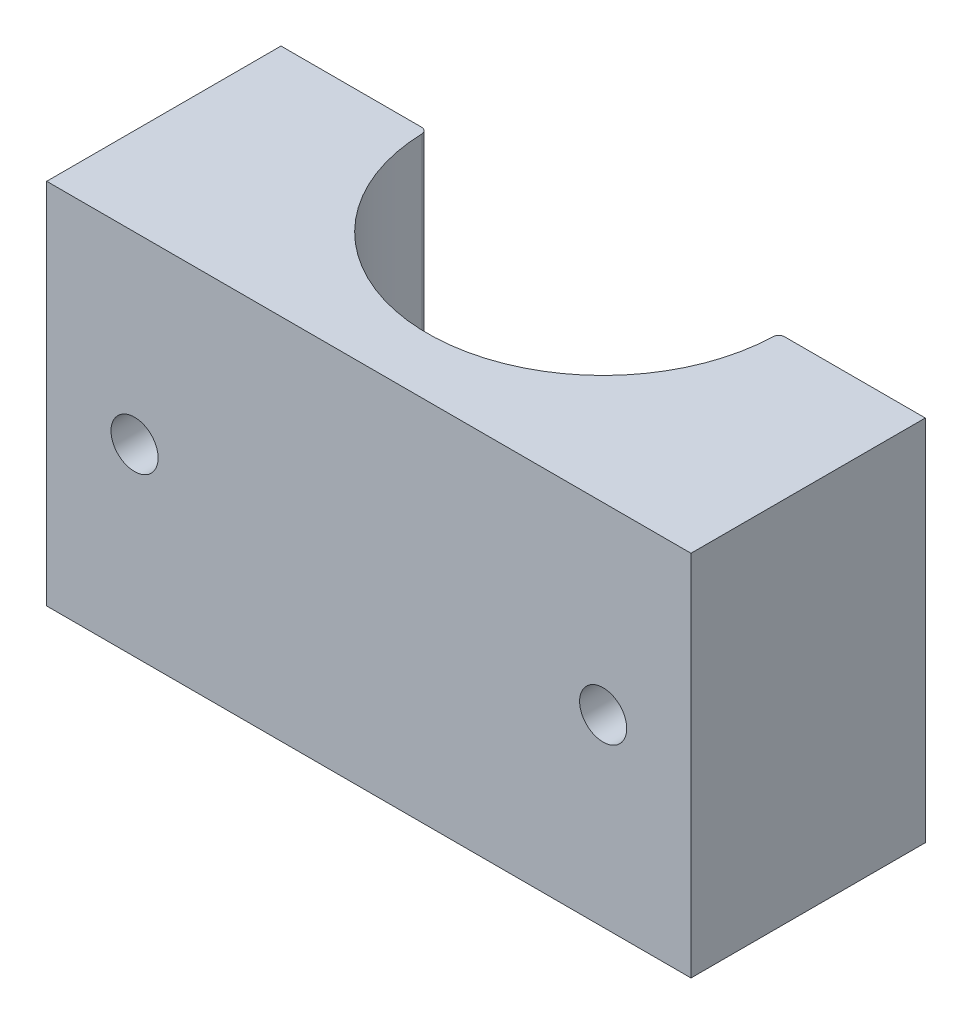
ISO-10303-21;
HEADER;
FILE_DESCRIPTION(('STEP AP214'),'2;1');
FILE_NAME('part.step','',(''),(''),'','','');
FILE_SCHEMA(('AUTOMOTIVE_DESIGN { 1 0 10303 214 1 1 1 1 }'));
ENDSEC;
DATA;
#1=APPLICATION_CONTEXT('core data for automotive mechanical design processes');
#2=APPLICATION_PROTOCOL_DEFINITION('international standard','automotive_design',2000,#1);
#3=PRODUCT_CONTEXT('',#1,'mechanical');
#4=PRODUCT('Part','Part','',(#3));
#5=PRODUCT_RELATED_PRODUCT_CATEGORY('part','',(#4));
#6=PRODUCT_DEFINITION_FORMATION('','',#4);
#7=PRODUCT_DEFINITION_CONTEXT('part definition',#1,'design');
#8=PRODUCT_DEFINITION('design','',#6,#7);
#9=PRODUCT_DEFINITION_SHAPE('','',#8);
#10=(LENGTH_UNIT() NAMED_UNIT(*) SI_UNIT(.MILLI.,.METRE.));
#11=(NAMED_UNIT(*) PLANE_ANGLE_UNIT() SI_UNIT($,.RADIAN.));
#12=(NAMED_UNIT(*) SI_UNIT($,.STERADIAN.) SOLID_ANGLE_UNIT());
#13=UNCERTAINTY_MEASURE_WITH_UNIT(LENGTH_MEASURE(1.E-05),#10,'distance_accuracy_value','');
#14=(GEOMETRIC_REPRESENTATION_CONTEXT(3) GLOBAL_UNCERTAINTY_ASSIGNED_CONTEXT((#13)) GLOBAL_UNIT_ASSIGNED_CONTEXT((#10,
#11,#12)) REPRESENTATION_CONTEXT('',''));
#15=CARTESIAN_POINT('',(0.,0.,0.));
#16=DIRECTION('',(0.,0.,1.));
#17=DIRECTION('',(1.,0.,0.));
#18=AXIS2_PLACEMENT_3D('',#15,#16,#17);
#19=CARTESIAN_POINT('',(-34.925,-39.878,0.));
#20=DIRECTION('',(0.,0.,-1.));
#21=DIRECTION('',(-1.,0.,0.));
#22=AXIS2_PLACEMENT_3D('',#19,#20,#21);
#23=PLANE('',#22);
#24=CARTESIAN_POINT('',(-30.1625,-7.239,0.));
#25=DIRECTION('',(0.,0.,-1.));
#26=DIRECTION('',(-1.,0.,0.));
#27=AXIS2_PLACEMENT_3D('',#24,#25,#26);
#28=CIRCLE('',#27,2.45744999999999);
#29=CARTESIAN_POINT('',(-32.61995,-7.239,0.));
#30=VERTEX_POINT('',#29);
#31=EDGE_CURVE('E149',#30,#30,#28,.T.);
#32=ORIENTED_EDGE('',*,*,#31,.F.);
#33=EDGE_LOOP('',(#32));
#34=FACE_BOUND('',#33,.T.);
#35=CARTESIAN_POINT('',(-30.1625,-32.639,0.));
#36=DIRECTION('',(0.,0.,-1.));
#37=DIRECTION('',(-1.,0.,0.));
#38=AXIS2_PLACEMENT_3D('',#35,#36,#37);
#39=CIRCLE('',#38,2.45744999999999);
#40=CARTESIAN_POINT('',(-32.61995,-32.639,0.));
#41=VERTEX_POINT('',#40);
#42=EDGE_CURVE('E148',#41,#41,#39,.T.);
#43=ORIENTED_EDGE('',*,*,#42,.F.);
#44=EDGE_LOOP('',(#43));
#45=FACE_BOUND('',#44,.T.);
#46=CARTESIAN_POINT('',(-25.4,-19.939,0.));
#47=DIRECTION('',(0.,0.,-1.));
#48=DIRECTION('',(-1.,0.,0.));
#49=AXIS2_PLACEMENT_3D('',#46,#47,#48);
#50=CIRCLE('',#49,4.8895);
#51=CARTESIAN_POINT('',(-30.2895,-19.939,0.));
#52=VERTEX_POINT('',#51);
#53=EDGE_CURVE('E162',#52,#52,#50,.T.);
#54=ORIENTED_EDGE('',*,*,#53,.F.);
#55=EDGE_LOOP('',(#54));
#56=FACE_BOUND('',#55,.T.);
#57=DIRECTION('',(-1.,0.,0.));
#58=VECTOR('',#57,1.);
#59=CARTESIAN_POINT('',(-34.925,0.,0.));
#60=LINE('',#59,#58);
#61=CARTESIAN_POINT('',(-19.6747553987337,0.,0.));
#62=VERTEX_POINT('',#61);
#63=CARTESIAN_POINT('',(-34.925,0.,0.));
#64=VERTEX_POINT('',#63);
#65=EDGE_CURVE('E202',#62,#64,#60,.T.);
#66=ORIENTED_EDGE('',*,*,#65,.F.);
#67=DIRECTION('',(0.,1.,0.));
#68=VECTOR('',#67,1.);
#69=CARTESIAN_POINT('',(-19.6747553987337,-39.878,0.));
#70=LINE('',#69,#68);
#71=CARTESIAN_POINT('',(-19.6747553987337,-39.878,0.));
#72=VERTEX_POINT('',#71);
#73=EDGE_CURVE('E11',#62,#72,#70,.F.);
#74=ORIENTED_EDGE('',*,*,#73,.T.);
#75=DIRECTION('',(-1.,0.,0.));
#76=VECTOR('',#75,1.);
#77=CARTESIAN_POINT('',(-34.925,-39.878,0.));
#78=LINE('',#77,#76);
#79=CARTESIAN_POINT('',(-34.925,-39.878,0.));
#80=VERTEX_POINT('',#79);
#81=EDGE_CURVE('E203',#72,#80,#78,.T.);
#82=ORIENTED_EDGE('',*,*,#81,.T.);
#83=DIRECTION('',(0.,1.,0.));
#84=VECTOR('',#83,1.);
#85=CARTESIAN_POINT('',(-34.925,-39.878,0.));
#86=LINE('',#85,#84);
#87=EDGE_CURVE('E226',#80,#64,#86,.T.);
#88=ORIENTED_EDGE('',*,*,#87,.T.);
#89=EDGE_LOOP('',(#66,#74,#82,#88));
#90=FACE_BOUND('',#89,.T.);
#91=ADVANCED_FACE('F43',(#34,#45,#56,#90),#23,.T.);
#92=CARTESIAN_POINT('',(0.,-39.878,0.));
#93=DIRECTION('',(0.,1.,0.));
#94=DIRECTION('',(0.,0.,1.));
#95=AXIS2_PLACEMENT_3D('',#92,#93,#94);
#96=CYLINDRICAL_SURFACE('',#95,19.05);
#97=CARTESIAN_POINT('',(0.,0.,0.));
#98=DIRECTION('',(0.,-1.,0.));
#99=DIRECTION('',(0.,0.,1.));
#100=AXIS2_PLACEMENT_3D('',#97,#98,#99);
#101=CIRCLE('',#100,19.05);
#102=CARTESIAN_POINT('',(19.0400858697423,0.,0.614516129032258));
#103=VERTEX_POINT('',#102);
#104=CARTESIAN_POINT('',(-19.0400858697423,0.,0.614516129032258));
#105=VERTEX_POINT('',#104);
#106=EDGE_CURVE('E207',#103,#105,#101,.T.);
#107=ORIENTED_EDGE('',*,*,#106,.F.);
#108=DIRECTION('',(0.,1.,0.));
#109=VECTOR('',#108,1.);
#110=CARTESIAN_POINT('',(19.0400858697423,-39.878,0.614516129032258));
#111=LINE('',#110,#109);
#112=CARTESIAN_POINT('',(19.0400858697423,-39.878,0.614516129032258));
#113=VERTEX_POINT('',#112);
#114=EDGE_CURVE('E274',#103,#113,#111,.F.);
#115=ORIENTED_EDGE('',*,*,#114,.T.);
#116=CARTESIAN_POINT('',(0.,-39.878,0.));
#117=DIRECTION('',(0.,-1.,0.));
#118=DIRECTION('',(0.,0.,1.));
#119=AXIS2_PLACEMENT_3D('',#116,#117,#118);
#120=CIRCLE('',#119,19.05);
#121=CARTESIAN_POINT('',(-19.0400858697423,-39.878,0.614516129032258));
#122=VERTEX_POINT('',#121);
#123=EDGE_CURVE('E223',#113,#122,#120,.T.);
#124=ORIENTED_EDGE('',*,*,#123,.T.);
#125=DIRECTION('',(0.,1.,0.));
#126=VECTOR('',#125,1.);
#127=CARTESIAN_POINT('',(-19.0400858697423,-39.878,0.614516129032258));
#128=LINE('',#127,#126);
#129=EDGE_CURVE('E270',#122,#105,#128,.T.);
#130=ORIENTED_EDGE('',*,*,#129,.T.);
#131=EDGE_LOOP('',(#107,#115,#124,#130));
#132=FACE_BOUND('',#131,.T.);
#133=ADVANCED_FACE('F294',(#132),#96,.F.);
#134=CARTESIAN_POINT('',(19.05,-39.878,0.));
#135=DIRECTION('',(0.,0.,-1.));
#136=DIRECTION('',(-1.,0.,0.));
#137=AXIS2_PLACEMENT_3D('',#134,#135,#136);
#138=PLANE('',#137);
#139=CARTESIAN_POINT('',(30.1625,-7.239,0.));
#140=DIRECTION('',(0.,0.,-1.));
#141=DIRECTION('',(-1.,0.,0.));
#142=AXIS2_PLACEMENT_3D('',#139,#140,#141);
#143=CIRCLE('',#142,2.45744999999999);
#144=CARTESIAN_POINT('',(27.70505,-7.239,0.));
#145=VERTEX_POINT('',#144);
#146=EDGE_CURVE('E174',#145,#145,#143,.T.);
#147=ORIENTED_EDGE('',*,*,#146,.F.);
#148=EDGE_LOOP('',(#147));
#149=FACE_BOUND('',#148,.T.);
#150=CARTESIAN_POINT('',(30.1625,-32.639,0.));
#151=DIRECTION('',(0.,0.,-1.));
#152=DIRECTION('',(-1.,0.,0.));
#153=AXIS2_PLACEMENT_3D('',#150,#151,#152);
#154=CIRCLE('',#153,2.45744999999999);
#155=CARTESIAN_POINT('',(27.70505,-32.639,0.));
#156=VERTEX_POINT('',#155);
#157=EDGE_CURVE('E182',#156,#156,#154,.T.);
#158=ORIENTED_EDGE('',*,*,#157,.F.);
#159=EDGE_LOOP('',(#158));
#160=FACE_BOUND('',#159,.T.);
#161=CARTESIAN_POINT('',(25.4,-19.939,0.));
#162=DIRECTION('',(0.,0.,-1.));
#163=DIRECTION('',(-1.,0.,0.));
#164=AXIS2_PLACEMENT_3D('',#161,#162,#163);
#165=CIRCLE('',#164,4.8895);
#166=CARTESIAN_POINT('',(20.5105,-19.939,0.));
#167=VERTEX_POINT('',#166);
#168=EDGE_CURVE('E190',#167,#167,#165,.T.);
#169=ORIENTED_EDGE('',*,*,#168,.F.);
#170=EDGE_LOOP('',(#169));
#171=FACE_BOUND('',#170,.T.);
#172=DIRECTION('',(-1.,0.,0.));
#173=VECTOR('',#172,1.);
#174=CARTESIAN_POINT('',(19.05,-39.878,0.));
#175=LINE('',#174,#173);
#176=CARTESIAN_POINT('',(34.925,-39.878,0.));
#177=VERTEX_POINT('',#176);
#178=CARTESIAN_POINT('',(19.6747553987337,-39.878,0.));
#179=VERTEX_POINT('',#178);
#180=EDGE_CURVE('E219',#177,#179,#175,.T.);
#181=ORIENTED_EDGE('',*,*,#180,.T.);
#182=DIRECTION('',(0.,1.,0.));
#183=VECTOR('',#182,1.);
#184=CARTESIAN_POINT('',(19.6747553987337,-39.878,0.));
#185=LINE('',#184,#183);
#186=CARTESIAN_POINT('',(19.6747553987337,0.,0.));
#187=VERTEX_POINT('',#186);
#188=EDGE_CURVE('E251',#179,#187,#185,.T.);
#189=ORIENTED_EDGE('',*,*,#188,.T.);
#190=DIRECTION('',(-1.,0.,0.));
#191=VECTOR('',#190,1.);
#192=CARTESIAN_POINT('',(19.05,0.,0.));
#193=LINE('',#192,#191);
#194=CARTESIAN_POINT('',(34.925,0.,0.));
#195=VERTEX_POINT('',#194);
#196=EDGE_CURVE('E241',#195,#187,#193,.T.);
#197=ORIENTED_EDGE('',*,*,#196,.F.);
#198=DIRECTION('',(0.,1.,0.));
#199=VECTOR('',#198,1.);
#200=CARTESIAN_POINT('',(34.925,-39.878,0.));
#201=LINE('',#200,#199);
#202=EDGE_CURVE('E248',#177,#195,#201,.T.);
#203=ORIENTED_EDGE('',*,*,#202,.F.);
#204=EDGE_LOOP('',(#181,#189,#197,#203));
#205=FACE_BOUND('',#204,.T.);
#206=ADVANCED_FACE('F287',(#149,#160,#171,#205),#138,.T.);
#207=CARTESIAN_POINT('',(34.925,-39.878,25.4));
#208=DIRECTION('',(1.,0.,0.));
#209=DIRECTION('',(0.,0.,-1.));
#210=AXIS2_PLACEMENT_3D('',#207,#208,#209);
#211=PLANE('',#210);
#212=DIRECTION('',(0.,0.,-1.));
#213=VECTOR('',#212,1.);
#214=CARTESIAN_POINT('',(34.925,0.,25.4));
#215=LINE('',#214,#213);
#216=CARTESIAN_POINT('',(34.925,0.,25.4));
#217=VERTEX_POINT('',#216);
#218=EDGE_CURVE('E237',#217,#195,#215,.T.);
#219=ORIENTED_EDGE('',*,*,#218,.F.);
#220=DIRECTION('',(0.,1.,0.));
#221=VECTOR('',#220,1.);
#222=CARTESIAN_POINT('',(34.925,-39.878,25.4));
#223=LINE('',#222,#221);
#224=CARTESIAN_POINT('',(34.925,-39.878,25.4));
#225=VERTEX_POINT('',#224);
#226=EDGE_CURVE('E252',#225,#217,#223,.T.);
#227=ORIENTED_EDGE('',*,*,#226,.F.);
#228=DIRECTION('',(0.,0.,-1.));
#229=VECTOR('',#228,1.);
#230=CARTESIAN_POINT('',(34.925,-39.878,25.4));
#231=LINE('',#230,#229);
#232=EDGE_CURVE('E215',#225,#177,#231,.T.);
#233=ORIENTED_EDGE('',*,*,#232,.T.);
#234=ORIENTED_EDGE('',*,*,#202,.T.);
#235=EDGE_LOOP('',(#219,#227,#233,#234));
#236=FACE_BOUND('',#235,.T.);
#237=ADVANCED_FACE('F308',(#236),#211,.T.);
#238=CARTESIAN_POINT('',(-34.925,-39.878,25.4));
#239=DIRECTION('',(0.,0.,1.));
#240=DIRECTION('',(1.,0.,0.));
#241=AXIS2_PLACEMENT_3D('',#238,#239,#240);
#242=PLANE('',#241);
#243=CARTESIAN_POINT('',(-25.4,-19.939,25.4));
#244=DIRECTION('',(0.,0.,-1.));
#245=DIRECTION('',(-1.,0.,0.));
#246=AXIS2_PLACEMENT_3D('',#243,#244,#245);
#247=CIRCLE('',#246,2.55269999999999);
#248=CARTESIAN_POINT('',(-27.9527,-19.939,25.4));
#249=VERTEX_POINT('',#248);
#250=EDGE_CURVE('E170',#249,#249,#247,.T.);
#251=ORIENTED_EDGE('',*,*,#250,.T.);
#252=EDGE_LOOP('',(#251));
#253=FACE_BOUND('',#252,.T.);
#254=CARTESIAN_POINT('',(25.4,-19.939,25.4));
#255=DIRECTION('',(0.,0.,-1.));
#256=DIRECTION('',(-1.,0.,0.));
#257=AXIS2_PLACEMENT_3D('',#254,#255,#256);
#258=CIRCLE('',#257,2.55269999999999);
#259=CARTESIAN_POINT('',(22.8473,-19.939,25.4));
#260=VERTEX_POINT('',#259);
#261=EDGE_CURVE('E198',#260,#260,#258,.T.);
#262=ORIENTED_EDGE('',*,*,#261,.T.);
#263=EDGE_LOOP('',(#262));
#264=FACE_BOUND('',#263,.T.);
#265=DIRECTION('',(1.,0.,0.));
#266=VECTOR('',#265,1.);
#267=CARTESIAN_POINT('',(-34.925,0.,25.4));
#268=LINE('',#267,#266);
#269=CARTESIAN_POINT('',(-34.925,0.,25.4));
#270=VERTEX_POINT('',#269);
#271=EDGE_CURVE('E233',#270,#217,#268,.T.);
#272=ORIENTED_EDGE('',*,*,#271,.F.);
#273=DIRECTION('',(0.,1.,0.));
#274=VECTOR('',#273,1.);
#275=CARTESIAN_POINT('',(-34.925,-39.878,25.4));
#276=LINE('',#275,#274);
#277=CARTESIAN_POINT('',(-34.925,-39.878,25.4));
#278=VERTEX_POINT('',#277);
#279=EDGE_CURVE('E255',#278,#270,#276,.T.);
#280=ORIENTED_EDGE('',*,*,#279,.F.);
#281=DIRECTION('',(1.,0.,0.));
#282=VECTOR('',#281,1.);
#283=CARTESIAN_POINT('',(-34.925,-39.878,25.4));
#284=LINE('',#283,#282);
#285=EDGE_CURVE('E211',#278,#225,#284,.T.);
#286=ORIENTED_EDGE('',*,*,#285,.T.);
#287=ORIENTED_EDGE('',*,*,#226,.T.);
#288=EDGE_LOOP('',(#272,#280,#286,#287));
#289=FACE_BOUND('',#288,.T.);
#290=ADVANCED_FACE('F305',(#253,#264,#289),#242,.T.);
#291=CARTESIAN_POINT('',(-34.925,-39.878,0.));
#292=DIRECTION('',(-1.,0.,0.));
#293=DIRECTION('',(0.,0.,1.));
#294=AXIS2_PLACEMENT_3D('',#291,#292,#293);
#295=PLANE('',#294);
#296=DIRECTION('',(0.,0.,1.));
#297=VECTOR('',#296,1.);
#298=CARTESIAN_POINT('',(-34.925,0.,0.));
#299=LINE('',#298,#297);
#300=EDGE_CURVE('E229',#64,#270,#299,.T.);
#301=ORIENTED_EDGE('',*,*,#300,.F.);
#302=ORIENTED_EDGE('',*,*,#87,.F.);
#303=DIRECTION('',(0.,0.,1.));
#304=VECTOR('',#303,1.);
#305=CARTESIAN_POINT('',(-34.925,-39.878,0.));
#306=LINE('',#305,#304);
#307=EDGE_CURVE('E206',#80,#278,#306,.T.);
#308=ORIENTED_EDGE('',*,*,#307,.T.);
#309=ORIENTED_EDGE('',*,*,#279,.T.);
#310=EDGE_LOOP('',(#301,#302,#308,#309));
#311=FACE_BOUND('',#310,.T.);
#312=ADVANCED_FACE('F301',(#311),#295,.T.);
#313=CARTESIAN_POINT('',(0.,-39.878,0.));
#314=DIRECTION('',(0.,1.,0.));
#315=DIRECTION('',(0.,0.,1.));
#316=AXIS2_PLACEMENT_3D('',#313,#314,#315);
#317=PLANE('',#316);
#318=ORIENTED_EDGE('',*,*,#123,.F.);
#319=CARTESIAN_POINT('',(19.6747553987337,-39.878,0.635));
#320=DIRECTION('',(0.,1.,0.));
#321=DIRECTION('',(0.,0.,1.));
#322=AXIS2_PLACEMENT_3D('',#319,#320,#321);
#323=CIRCLE('',#322,0.635);
#324=EDGE_CURVE('E52',#113,#179,#323,.F.);
#325=ORIENTED_EDGE('',*,*,#324,.T.);
#326=ORIENTED_EDGE('',*,*,#180,.F.);
#327=ORIENTED_EDGE('',*,*,#232,.F.);
#328=ORIENTED_EDGE('',*,*,#285,.F.);
#329=ORIENTED_EDGE('',*,*,#307,.F.);
#330=ORIENTED_EDGE('',*,*,#81,.F.);
#331=CARTESIAN_POINT('',(-19.6747553987337,-39.878,0.635));
#332=DIRECTION('',(0.,1.,0.));
#333=DIRECTION('',(0.,0.,1.));
#334=AXIS2_PLACEMENT_3D('',#331,#332,#333);
#335=CIRCLE('',#334,0.635);
#336=EDGE_CURVE('E68',#72,#122,#335,.F.);
#337=ORIENTED_EDGE('',*,*,#336,.T.);
#338=EDGE_LOOP('',(#318,#325,#326,#327,#328,#329,#330,#337));
#339=FACE_BOUND('',#338,.T.);
#340=ADVANCED_FACE('F281',(#339),#317,.F.);
#341=CARTESIAN_POINT('',(0.,0.,0.));
#342=DIRECTION('',(0.,1.,0.));
#343=DIRECTION('',(0.,0.,1.));
#344=AXIS2_PLACEMENT_3D('',#341,#342,#343);
#345=PLANE('',#344);
#346=ORIENTED_EDGE('',*,*,#196,.T.);
#347=CARTESIAN_POINT('',(19.6747553987337,0.,0.635));
#348=DIRECTION('',(0.,1.,0.));
#349=DIRECTION('',(0.,0.,1.));
#350=AXIS2_PLACEMENT_3D('',#347,#348,#349);
#351=CIRCLE('',#350,0.635);
#352=EDGE_CURVE('E267',#187,#103,#351,.T.);
#353=ORIENTED_EDGE('',*,*,#352,.T.);
#354=ORIENTED_EDGE('',*,*,#106,.T.);
#355=CARTESIAN_POINT('',(-19.6747553987337,0.,0.635));
#356=DIRECTION('',(0.,1.,0.));
#357=DIRECTION('',(0.,0.,1.));
#358=AXIS2_PLACEMENT_3D('',#355,#356,#357);
#359=CIRCLE('',#358,0.635);
#360=EDGE_CURVE('E264',#105,#62,#359,.T.);
#361=ORIENTED_EDGE('',*,*,#360,.T.);
#362=ORIENTED_EDGE('',*,*,#65,.T.);
#363=ORIENTED_EDGE('',*,*,#300,.T.);
#364=ORIENTED_EDGE('',*,*,#271,.T.);
#365=ORIENTED_EDGE('',*,*,#218,.T.);
#366=EDGE_LOOP('',(#346,#353,#354,#361,#362,#363,#364,#365));
#367=FACE_BOUND('',#366,.T.);
#368=ADVANCED_FACE('F292',(#367),#345,.T.);
#369=CARTESIAN_POINT('',(19.6747553987337,-39.878,0.635));
#370=DIRECTION('',(0.,1.,0.));
#371=DIRECTION('',(0.,0.,1.));
#372=AXIS2_PLACEMENT_3D('',#369,#370,#371);
#373=CYLINDRICAL_SURFACE('',#372,0.635);
#374=ORIENTED_EDGE('',*,*,#324,.F.);
#375=ORIENTED_EDGE('',*,*,#114,.F.);
#376=ORIENTED_EDGE('',*,*,#352,.F.);
#377=ORIENTED_EDGE('',*,*,#188,.F.);
#378=EDGE_LOOP('',(#374,#375,#376,#377));
#379=FACE_BOUND('',#378,.T.);
#380=ADVANCED_FACE('F289',(#379),#373,.T.);
#381=CARTESIAN_POINT('',(-19.6747553987337,-39.878,0.635));
#382=DIRECTION('',(0.,1.,0.));
#383=DIRECTION('',(0.,0.,1.));
#384=AXIS2_PLACEMENT_3D('',#381,#382,#383);
#385=CYLINDRICAL_SURFACE('',#384,0.635);
#386=ORIENTED_EDGE('',*,*,#336,.F.);
#387=ORIENTED_EDGE('',*,*,#73,.F.);
#388=ORIENTED_EDGE('',*,*,#360,.F.);
#389=ORIENTED_EDGE('',*,*,#129,.F.);
#390=EDGE_LOOP('',(#386,#387,#388,#389));
#391=FACE_BOUND('',#390,.T.);
#392=ADVANCED_FACE('F45',(#391),#385,.T.);
#393=CARTESIAN_POINT('',(25.4,-19.939,0.));
#394=DIRECTION('',(0.,0.,-1.));
#395=DIRECTION('',(-1.,0.,0.));
#396=AXIS2_PLACEMENT_3D('',#393,#394,#395);
#397=CYLINDRICAL_SURFACE('',#396,2.5527);
#398=ORIENTED_EDGE('',*,*,#261,.F.);
#399=EDGE_LOOP('',(#398));
#400=FACE_BOUND('',#399,.T.);
#401=CARTESIAN_POINT('',(25.4,-19.939,2.68818089399405));
#402=DIRECTION('',(0.,0.,-1.));
#403=DIRECTION('',(-1.,0.,0.));
#404=AXIS2_PLACEMENT_3D('',#401,#402,#403);
#405=CIRCLE('',#404,2.5527);
#406=CARTESIAN_POINT('',(22.8473,-19.939,2.68818089399405));
#407=VERTEX_POINT('',#406);
#408=EDGE_CURVE('E194',#407,#407,#405,.T.);
#409=ORIENTED_EDGE('',*,*,#408,.T.);
#410=EDGE_LOOP('',(#409));
#411=FACE_BOUND('',#410,.T.);
#412=ADVANCED_FACE('F334',(#400,#411),#397,.F.);
#413=CARTESIAN_POINT('',(25.4,-19.939,0.));
#414=DIRECTION('',(0.,0.,-1.));
#415=DIRECTION('',(-1.,0.,0.));
#416=AXIS2_PLACEMENT_3D('',#413,#414,#415);
#417=CONICAL_SURFACE('',#416,4.8895,0.715584993317676);
#418=ORIENTED_EDGE('',*,*,#408,.F.);
#419=EDGE_LOOP('',(#418));
#420=FACE_BOUND('',#419,.T.);
#421=ORIENTED_EDGE('',*,*,#168,.T.);
#422=EDGE_LOOP('',(#421));
#423=FACE_BOUND('',#422,.T.);
#424=ADVANCED_FACE('F343',(#420,#423),#417,.F.);
#425=CARTESIAN_POINT('',(30.1625,-32.639,12.7));
#426=DIRECTION('',(0.,0.,-1.));
#427=DIRECTION('',(-1.,0.,0.));
#428=AXIS2_PLACEMENT_3D('',#425,#426,#427);
#429=CONICAL_SURFACE('',#428,2.45745,1.02974425867665);
#430=CARTESIAN_POINT('',(30.1625,-32.639,14.1765849282293));
#431=VERTEX_POINT('',#430);
#432=VERTEX_LOOP('',#431);
#433=FACE_BOUND('',#432,.T.);
#434=CARTESIAN_POINT('',(30.1625,-32.639,12.7));
#435=DIRECTION('',(0.,0.,-1.));
#436=DIRECTION('',(-1.,0.,0.));
#437=AXIS2_PLACEMENT_3D('',#434,#435,#436);
#438=CIRCLE('',#437,2.45745);
#439=CARTESIAN_POINT('',(27.70505,-32.639,12.7));
#440=VERTEX_POINT('',#439);
#441=EDGE_CURVE('E186',#440,#440,#438,.T.);
#442=ORIENTED_EDGE('',*,*,#441,.T.);
#443=EDGE_LOOP('',(#442));
#444=FACE_BOUND('',#443,.T.);
#445=ADVANCED_FACE('F347',(#433,#444),#429,.F.);
#446=CARTESIAN_POINT('',(30.1625,-32.639,0.));
#447=DIRECTION('',(0.,0.,-1.));
#448=DIRECTION('',(-1.,0.,0.));
#449=AXIS2_PLACEMENT_3D('',#446,#447,#448);
#450=CYLINDRICAL_SURFACE('',#449,2.45744999999999);
#451=ORIENTED_EDGE('',*,*,#441,.F.);
#452=EDGE_LOOP('',(#451));
#453=FACE_BOUND('',#452,.T.);
#454=ORIENTED_EDGE('',*,*,#157,.T.);
#455=EDGE_LOOP('',(#454));
#456=FACE_BOUND('',#455,.T.);
#457=ADVANCED_FACE('F351',(#453,#456),#450,.F.);
#458=CARTESIAN_POINT('',(30.1625,-7.239,12.7));
#459=DIRECTION('',(0.,0.,-1.));
#460=DIRECTION('',(-1.,0.,0.));
#461=AXIS2_PLACEMENT_3D('',#458,#459,#460);
#462=CONICAL_SURFACE('',#461,2.45745,1.02974425867665);
#463=CARTESIAN_POINT('',(30.1625,-7.239,14.1765849282293));
#464=VERTEX_POINT('',#463);
#465=VERTEX_LOOP('',#464);
#466=FACE_BOUND('',#465,.T.);
#467=CARTESIAN_POINT('',(30.1625,-7.239,12.7));
#468=DIRECTION('',(0.,0.,-1.));
#469=DIRECTION('',(-1.,0.,0.));
#470=AXIS2_PLACEMENT_3D('',#467,#468,#469);
#471=CIRCLE('',#470,2.45745);
#472=CARTESIAN_POINT('',(27.70505,-7.239,12.7));
#473=VERTEX_POINT('',#472);
#474=EDGE_CURVE('E178',#473,#473,#471,.T.);
#475=ORIENTED_EDGE('',*,*,#474,.T.);
#476=EDGE_LOOP('',(#475));
#477=FACE_BOUND('',#476,.T.);
#478=ADVANCED_FACE('F355',(#466,#477),#462,.F.);
#479=CARTESIAN_POINT('',(30.1625,-7.239,0.));
#480=DIRECTION('',(0.,0.,-1.));
#481=DIRECTION('',(-1.,0.,0.));
#482=AXIS2_PLACEMENT_3D('',#479,#480,#481);
#483=CYLINDRICAL_SURFACE('',#482,2.45745);
#484=ORIENTED_EDGE('',*,*,#474,.F.);
#485=EDGE_LOOP('',(#484));
#486=FACE_BOUND('',#485,.T.);
#487=ORIENTED_EDGE('',*,*,#146,.T.);
#488=EDGE_LOOP('',(#487));
#489=FACE_BOUND('',#488,.T.);
#490=ADVANCED_FACE('F359',(#486,#489),#483,.F.);
#491=CARTESIAN_POINT('',(-25.4,-19.939,0.));
#492=DIRECTION('',(0.,0.,-1.));
#493=DIRECTION('',(-1.,0.,0.));
#494=AXIS2_PLACEMENT_3D('',#491,#492,#493);
#495=CYLINDRICAL_SURFACE('',#494,2.5527);
#496=ORIENTED_EDGE('',*,*,#250,.F.);
#497=EDGE_LOOP('',(#496));
#498=FACE_BOUND('',#497,.T.);
#499=CARTESIAN_POINT('',(-25.4,-19.939,2.68818089399405));
#500=DIRECTION('',(0.,0.,-1.));
#501=DIRECTION('',(-1.,0.,0.));
#502=AXIS2_PLACEMENT_3D('',#499,#500,#501);
#503=CIRCLE('',#502,2.5527);
#504=CARTESIAN_POINT('',(-27.9527,-19.939,2.68818089399405));
#505=VERTEX_POINT('',#504);
#506=EDGE_CURVE('E166',#505,#505,#503,.T.);
#507=ORIENTED_EDGE('',*,*,#506,.T.);
#508=EDGE_LOOP('',(#507));
#509=FACE_BOUND('',#508,.T.);
#510=ADVANCED_FACE('F363',(#498,#509),#495,.F.);
#511=CARTESIAN_POINT('',(-25.4,-19.939,0.));
#512=DIRECTION('',(0.,0.,-1.));
#513=DIRECTION('',(-1.,0.,0.));
#514=AXIS2_PLACEMENT_3D('',#511,#512,#513);
#515=CONICAL_SURFACE('',#514,4.8895,0.715584993317676);
#516=ORIENTED_EDGE('',*,*,#506,.F.);
#517=EDGE_LOOP('',(#516));
#518=FACE_BOUND('',#517,.T.);
#519=ORIENTED_EDGE('',*,*,#53,.T.);
#520=EDGE_LOOP('',(#519));
#521=FACE_BOUND('',#520,.T.);
#522=ADVANCED_FACE('F367',(#518,#521),#515,.F.);
#523=CARTESIAN_POINT('',(-30.1625,-32.639,12.7));
#524=DIRECTION('',(0.,0.,-1.));
#525=DIRECTION('',(-1.,0.,0.));
#526=AXIS2_PLACEMENT_3D('',#523,#524,#525);
#527=CONICAL_SURFACE('',#526,2.45745,1.02974425867665);
#528=CARTESIAN_POINT('',(-30.1625,-32.639,14.1765849282293));
#529=VERTEX_POINT('',#528);
#530=VERTEX_LOOP('',#529);
#531=FACE_BOUND('',#530,.T.);
#532=CARTESIAN_POINT('',(-30.1625,-32.639,12.7));
#533=DIRECTION('',(0.,0.,-1.));
#534=DIRECTION('',(-1.,0.,0.));
#535=AXIS2_PLACEMENT_3D('',#532,#533,#534);
#536=CIRCLE('',#535,2.45745);
#537=CARTESIAN_POINT('',(-32.61995,-32.639,12.7));
#538=VERTEX_POINT('',#537);
#539=EDGE_CURVE('E154',#538,#538,#536,.T.);
#540=ORIENTED_EDGE('',*,*,#539,.T.);
#541=EDGE_LOOP('',(#540));
#542=FACE_BOUND('',#541,.T.);
#543=ADVANCED_FACE('F371',(#531,#542),#527,.F.);
#544=CARTESIAN_POINT('',(-30.1625,-32.639,0.));
#545=DIRECTION('',(0.,0.,-1.));
#546=DIRECTION('',(-1.,0.,0.));
#547=AXIS2_PLACEMENT_3D('',#544,#545,#546);
#548=CYLINDRICAL_SURFACE('',#547,2.45744999999999);
#549=ORIENTED_EDGE('',*,*,#539,.F.);
#550=EDGE_LOOP('',(#549));
#551=FACE_BOUND('',#550,.T.);
#552=ORIENTED_EDGE('',*,*,#42,.T.);
#553=EDGE_LOOP('',(#552));
#554=FACE_BOUND('',#553,.T.);
#555=ADVANCED_FACE('F141',(#551,#554),#548,.F.);
#556=CARTESIAN_POINT('',(-30.1625,-7.239,12.7));
#557=DIRECTION('',(0.,0.,-1.));
#558=DIRECTION('',(-1.,0.,0.));
#559=AXIS2_PLACEMENT_3D('',#556,#557,#558);
#560=CONICAL_SURFACE('',#559,2.45745,1.02974425867665);
#561=CARTESIAN_POINT('',(-30.1625,-7.239,14.1765849282293));
#562=VERTEX_POINT('',#561);
#563=VERTEX_LOOP('',#562);
#564=FACE_BOUND('',#563,.T.);
#565=CARTESIAN_POINT('',(-30.1625,-7.239,12.7));
#566=DIRECTION('',(0.,0.,-1.));
#567=DIRECTION('',(-1.,0.,0.));
#568=AXIS2_PLACEMENT_3D('',#565,#566,#567);
#569=CIRCLE('',#568,2.45745);
#570=CARTESIAN_POINT('',(-32.61995,-7.239,12.7));
#571=VERTEX_POINT('',#570);
#572=EDGE_CURVE('E145',#571,#571,#569,.T.);
#573=ORIENTED_EDGE('',*,*,#572,.T.);
#574=EDGE_LOOP('',(#573));
#575=FACE_BOUND('',#574,.T.);
#576=ADVANCED_FACE('F137',(#564,#575),#560,.F.);
#577=CARTESIAN_POINT('',(-30.1625,-7.239,0.));
#578=DIRECTION('',(0.,0.,-1.));
#579=DIRECTION('',(-1.,0.,0.));
#580=AXIS2_PLACEMENT_3D('',#577,#578,#579);
#581=CYLINDRICAL_SURFACE('',#580,2.45744999999999);
#582=ORIENTED_EDGE('',*,*,#572,.F.);
#583=EDGE_LOOP('',(#582));
#584=FACE_BOUND('',#583,.T.);
#585=ORIENTED_EDGE('',*,*,#31,.T.);
#586=EDGE_LOOP('',(#585));
#587=FACE_BOUND('',#586,.T.);
#588=ADVANCED_FACE('F140',(#584,#587),#581,.F.);
#589=CLOSED_SHELL('',(#91,#133,#206,#237,#290,#312,#340,#368,#380,#392,#412,#424,#445,#457,#478,
#490,#510,#522,#543,#555,#576,#588));
#590=MANIFOLD_SOLID_BREP('B2',#589);
#591=ADVANCED_BREP_SHAPE_REPRESENTATION('',(#18,#590),#14);
#592=SHAPE_DEFINITION_REPRESENTATION(#9,#591);
ENDSEC;
END-ISO-10303-21;
